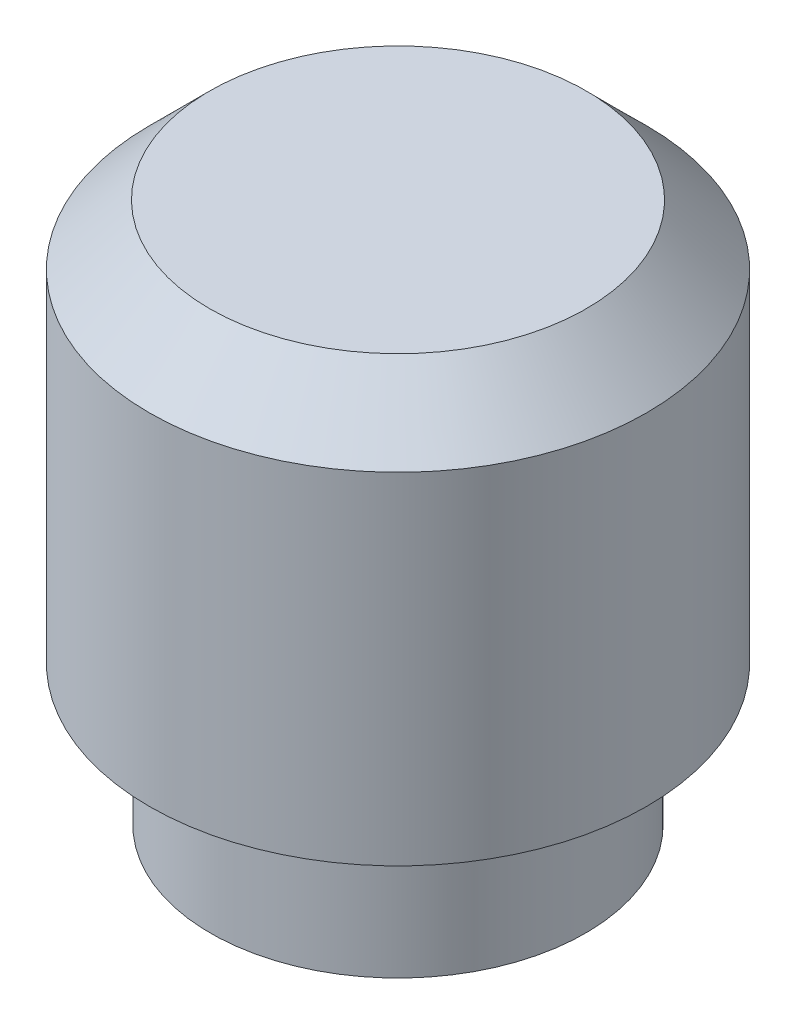
ISO-10303-21;
HEADER;
FILE_DESCRIPTION(('STEP AP214'),'2;1');
FILE_NAME('part.step','',(''),(''),'','','');
FILE_SCHEMA(('AUTOMOTIVE_DESIGN { 1 0 10303 214 1 1 1 1 }'));
ENDSEC;
DATA;
#1=APPLICATION_CONTEXT('core data for automotive mechanical design processes');
#2=APPLICATION_PROTOCOL_DEFINITION('international standard','automotive_design',2000,#1);
#3=PRODUCT_CONTEXT('',#1,'mechanical');
#4=PRODUCT('Part','Part','',(#3));
#5=PRODUCT_RELATED_PRODUCT_CATEGORY('part','',(#4));
#6=PRODUCT_DEFINITION_FORMATION('','',#4);
#7=PRODUCT_DEFINITION_CONTEXT('part definition',#1,'design');
#8=PRODUCT_DEFINITION('design','',#6,#7);
#9=PRODUCT_DEFINITION_SHAPE('','',#8);
#10=(LENGTH_UNIT() NAMED_UNIT(*) SI_UNIT(.MILLI.,.METRE.));
#11=(NAMED_UNIT(*) PLANE_ANGLE_UNIT() SI_UNIT($,.RADIAN.));
#12=(NAMED_UNIT(*) SI_UNIT($,.STERADIAN.) SOLID_ANGLE_UNIT());
#13=UNCERTAINTY_MEASURE_WITH_UNIT(LENGTH_MEASURE(1.E-05),#10,'distance_accuracy_value','');
#14=(GEOMETRIC_REPRESENTATION_CONTEXT(3) GLOBAL_UNCERTAINTY_ASSIGNED_CONTEXT((#13)) GLOBAL_UNIT_ASSIGNED_CONTEXT((#10,
#11,#12)) REPRESENTATION_CONTEXT('',''));
#15=CARTESIAN_POINT('',(0.,0.,0.));
#16=DIRECTION('',(0.,0.,1.));
#17=DIRECTION('',(1.,0.,0.));
#18=AXIS2_PLACEMENT_3D('',#15,#16,#17);
#19=CARTESIAN_POINT('',(0.,6.858,0.));
#20=DIRECTION('',(0.,1.,0.));
#21=DIRECTION('',(0.,0.,1.));
#22=AXIS2_PLACEMENT_3D('',#19,#20,#21);
#23=PLANE('',#22);
#24=CARTESIAN_POINT('',(0.,6.858,0.));
#25=DIRECTION('',(0.,1.,0.));
#26=DIRECTION('',(0.,0.,1.));
#27=AXIS2_PLACEMENT_3D('',#24,#25,#26);
#28=CIRCLE('',#27,2.3876);
#29=CARTESIAN_POINT('',(0.,6.858,2.3876));
#30=VERTEX_POINT('',#29);
#31=EDGE_CURVE('E11',#30,#30,#28,.T.);
#32=ORIENTED_EDGE('',*,*,#31,.T.);
#33=EDGE_LOOP('',(#32));
#34=FACE_BOUND('',#33,.T.);
#35=ADVANCED_FACE('F36',(#34),#23,.T.);
#36=CARTESIAN_POINT('',(0.,0.,0.));
#37=DIRECTION('',(0.,-1.,0.));
#38=DIRECTION('',(0.,0.,-1.));
#39=AXIS2_PLACEMENT_3D('',#36,#37,#38);
#40=CYLINDRICAL_SURFACE('',#39,3.1496);
#41=CARTESIAN_POINT('',(0.,6.096,0.));
#42=DIRECTION('',(0.,1.,0.));
#43=DIRECTION('',(0.,0.,1.));
#44=AXIS2_PLACEMENT_3D('',#41,#42,#43);
#45=CIRCLE('',#44,3.1496);
#46=CARTESIAN_POINT('',(0.,6.096,3.1496));
#47=VERTEX_POINT('',#46);
#48=EDGE_CURVE('E43',#47,#47,#45,.F.);
#49=ORIENTED_EDGE('',*,*,#48,.T.);
#50=EDGE_LOOP('',(#49));
#51=FACE_BOUND('',#50,.T.);
#52=CARTESIAN_POINT('',(0.,1.778,0.));
#53=DIRECTION('',(0.,-1.,0.));
#54=DIRECTION('',(0.,0.,-1.));
#55=AXIS2_PLACEMENT_3D('',#52,#53,#54);
#56=CIRCLE('',#55,3.1496);
#57=CARTESIAN_POINT('',(0.,1.778,-3.1496));
#58=VERTEX_POINT('',#57);
#59=EDGE_CURVE('E88',#58,#58,#56,.T.);
#60=ORIENTED_EDGE('',*,*,#59,.F.);
#61=EDGE_LOOP('',(#60));
#62=FACE_BOUND('',#61,.T.);
#63=ADVANCED_FACE('F64',(#51,#62),#40,.T.);
#64=CARTESIAN_POINT('',(3.1496,1.778,0.));
#65=DIRECTION('',(0.,-1.,0.));
#66=DIRECTION('',(0.,0.,-1.));
#67=AXIS2_PLACEMENT_3D('',#64,#65,#66);
#68=PLANE('',#67);
#69=CARTESIAN_POINT('',(0.,1.778,0.));
#70=DIRECTION('',(0.,-1.,0.));
#71=DIRECTION('',(0.,0.,-1.));
#72=AXIS2_PLACEMENT_3D('',#69,#70,#71);
#73=CIRCLE('',#72,2.5019);
#74=CARTESIAN_POINT('',(0.,1.778,-2.5019));
#75=VERTEX_POINT('',#74);
#76=EDGE_CURVE('E79',#75,#75,#73,.F.);
#77=ORIENTED_EDGE('',*,*,#76,.T.);
#78=EDGE_LOOP('',(#77));
#79=FACE_BOUND('',#78,.T.);
#80=ORIENTED_EDGE('',*,*,#59,.T.);
#81=EDGE_LOOP('',(#80));
#82=FACE_BOUND('',#81,.T.);
#83=ADVANCED_FACE('F69',(#79,#82),#68,.T.);
#84=CARTESIAN_POINT('',(0.,0.,0.));
#85=DIRECTION('',(0.,-1.,0.));
#86=DIRECTION('',(0.,0.,-1.));
#87=AXIS2_PLACEMENT_3D('',#84,#85,#86);
#88=CYLINDRICAL_SURFACE('',#87,2.3749);
#89=CARTESIAN_POINT('',(0.,1.651,0.));
#90=DIRECTION('',(0.,-1.,0.));
#91=DIRECTION('',(0.,0.,-1.));
#92=AXIS2_PLACEMENT_3D('',#89,#90,#91);
#93=CIRCLE('',#92,2.3749);
#94=CARTESIAN_POINT('',(0.,1.651,-2.3749));
#95=VERTEX_POINT('',#94);
#96=EDGE_CURVE('E82',#95,#95,#93,.T.);
#97=ORIENTED_EDGE('',*,*,#96,.T.);
#98=EDGE_LOOP('',(#97));
#99=FACE_BOUND('',#98,.T.);
#100=CARTESIAN_POINT('',(0.,0.,0.));
#101=DIRECTION('',(0.,-1.,0.));
#102=DIRECTION('',(0.,0.,-1.));
#103=AXIS2_PLACEMENT_3D('',#100,#101,#102);
#104=CIRCLE('',#103,2.3749);
#105=CARTESIAN_POINT('',(0.,0.,-2.3749));
#106=VERTEX_POINT('',#105);
#107=EDGE_CURVE('E92',#106,#106,#104,.T.);
#108=ORIENTED_EDGE('',*,*,#107,.F.);
#109=EDGE_LOOP('',(#108));
#110=FACE_BOUND('',#109,.T.);
#111=ADVANCED_FACE('F107',(#99,#110),#88,.T.);
#112=CARTESIAN_POINT('',(2.3749,0.,0.));
#113=DIRECTION('',(0.,-1.,0.));
#114=DIRECTION('',(0.,0.,-1.));
#115=AXIS2_PLACEMENT_3D('',#112,#113,#114);
#116=PLANE('',#115);
#117=ORIENTED_EDGE('',*,*,#107,.T.);
#118=EDGE_LOOP('',(#117));
#119=FACE_BOUND('',#118,.T.);
#120=CARTESIAN_POINT('',(0.,0.,0.));
#121=DIRECTION('',(0.,-1.,0.));
#122=DIRECTION('',(0.,0.,-1.));
#123=AXIS2_PLACEMENT_3D('',#120,#121,#122);
#124=CIRCLE('',#123,1.524);
#125=CARTESIAN_POINT('',(0.,0.,-1.524));
#126=VERTEX_POINT('',#125);
#127=EDGE_CURVE('E96',#126,#126,#124,.T.);
#128=ORIENTED_EDGE('',*,*,#127,.F.);
#129=EDGE_LOOP('',(#128));
#130=FACE_BOUND('',#129,.T.);
#131=ADVANCED_FACE('F59',(#119,#130),#116,.T.);
#132=CARTESIAN_POINT('',(0.,0.,0.));
#133=DIRECTION('',(0.,-1.,0.));
#134=DIRECTION('',(0.,0.,-1.));
#135=AXIS2_PLACEMENT_3D('',#132,#133,#134);
#136=CYLINDRICAL_SURFACE('',#135,1.524);
#137=ORIENTED_EDGE('',*,*,#127,.T.);
#138=EDGE_LOOP('',(#137));
#139=FACE_BOUND('',#138,.T.);
#140=CARTESIAN_POINT('',(0.,1.778,0.));
#141=DIRECTION('',(0.,-1.,0.));
#142=DIRECTION('',(0.,0.,-1.));
#143=AXIS2_PLACEMENT_3D('',#140,#141,#142);
#144=CIRCLE('',#143,1.524);
#145=CARTESIAN_POINT('',(0.,1.778,-1.524));
#146=VERTEX_POINT('',#145);
#147=EDGE_CURVE('E100',#146,#146,#144,.T.);
#148=ORIENTED_EDGE('',*,*,#147,.F.);
#149=EDGE_LOOP('',(#148));
#150=FACE_BOUND('',#149,.T.);
#151=ADVANCED_FACE('F49',(#139,#150),#136,.F.);
#152=CARTESIAN_POINT('',(0.,2.72697553616898,0.));
#153=DIRECTION('',(0.,-1.,0.));
#154=DIRECTION('',(0.,0.,-1.));
#155=AXIS2_PLACEMENT_3D('',#152,#153,#154);
#156=CONICAL_SURFACE('',#155,0.,1.01386176248351);
#157=ORIENTED_EDGE('',*,*,#147,.T.);
#158=EDGE_LOOP('',(#157));
#159=FACE_BOUND('',#158,.T.);
#160=CARTESIAN_POINT('',(0.,2.72697553616898,0.));
#161=VERTEX_POINT('',#160);
#162=VERTEX_LOOP('',#161);
#163=FACE_BOUND('',#162,.T.);
#164=ADVANCED_FACE('F46',(#159,#163),#156,.F.);
#165=CARTESIAN_POINT('',(0.,1.651,0.));
#166=DIRECTION('',(0.,-1.,0.));
#167=DIRECTION('',(0.,0.,-1.));
#168=AXIS2_PLACEMENT_3D('',#165,#166,#167);
#169=TOROIDAL_SURFACE('',#168,2.5019,0.127);
#170=ORIENTED_EDGE('',*,*,#76,.F.);
#171=EDGE_LOOP('',(#170));
#172=FACE_BOUND('',#171,.T.);
#173=ORIENTED_EDGE('',*,*,#96,.F.);
#174=EDGE_LOOP('',(#173));
#175=FACE_BOUND('',#174,.T.);
#176=ADVANCED_FACE('F48',(#172,#175),#169,.F.);
#177=CARTESIAN_POINT('',(0.,6.096,0.));
#178=DIRECTION('',(0.,-1.,0.));
#179=DIRECTION('',(0.,0.,-1.));
#180=AXIS2_PLACEMENT_3D('',#177,#178,#179);
#181=CONICAL_SURFACE('',#180,3.1496,0.785398163397449);
#182=ORIENTED_EDGE('',*,*,#31,.F.);
#183=EDGE_LOOP('',(#182));
#184=FACE_BOUND('',#183,.T.);
#185=ORIENTED_EDGE('',*,*,#48,.F.);
#186=EDGE_LOOP('',(#185));
#187=FACE_BOUND('',#186,.T.);
#188=ADVANCED_FACE('F56',(#184,#187),#181,.T.);
#189=CLOSED_SHELL('',(#35,#63,#83,#111,#131,#151,#164,#176,#188));
#190=MANIFOLD_SOLID_BREP('B2',#189);
#191=ADVANCED_BREP_SHAPE_REPRESENTATION('',(#18,#190),#14);
#192=SHAPE_DEFINITION_REPRESENTATION(#9,#191);
ENDSEC;
END-ISO-10303-21;
